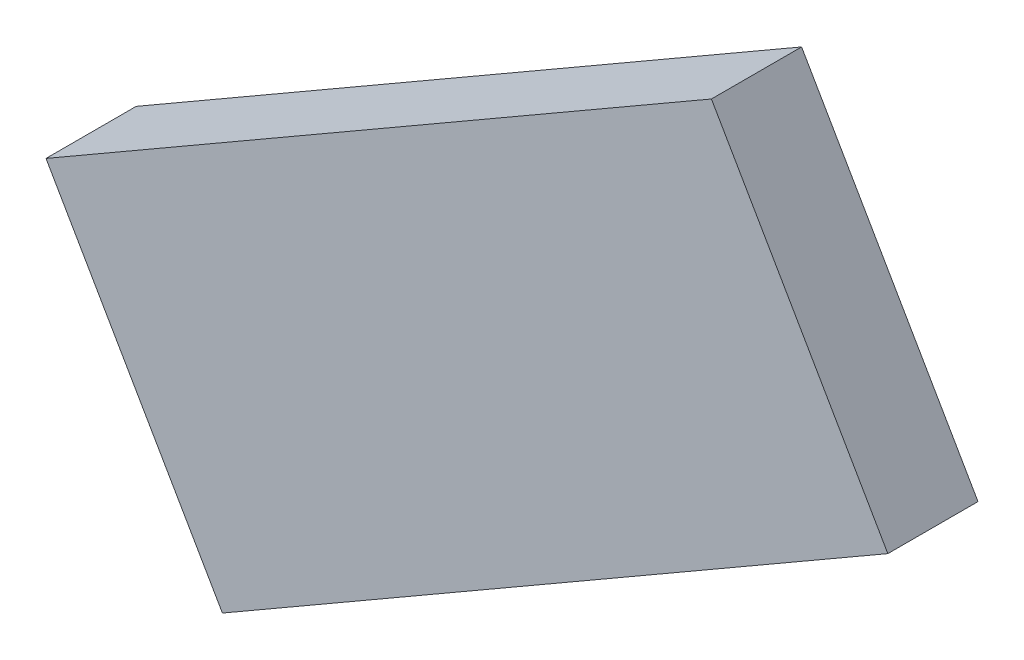
ISO-10303-21;
HEADER;
FILE_DESCRIPTION(('STEP AP214'),'2;1');
FILE_NAME('part.step','',(''),(''),'','','');
FILE_SCHEMA(('AUTOMOTIVE_DESIGN { 1 0 10303 214 1 1 1 1 }'));
ENDSEC;
DATA;
#1=APPLICATION_CONTEXT('core data for automotive mechanical design processes');
#2=APPLICATION_PROTOCOL_DEFINITION('international standard','automotive_design',2000,#1);
#3=PRODUCT_CONTEXT('',#1,'mechanical');
#4=PRODUCT('Part','Part','',(#3));
#5=PRODUCT_RELATED_PRODUCT_CATEGORY('part','',(#4));
#6=PRODUCT_DEFINITION_FORMATION('','',#4);
#7=PRODUCT_DEFINITION_CONTEXT('part definition',#1,'design');
#8=PRODUCT_DEFINITION('design','',#6,#7);
#9=PRODUCT_DEFINITION_SHAPE('','',#8);
#10=(LENGTH_UNIT() NAMED_UNIT(*) SI_UNIT(.MILLI.,.METRE.));
#11=(NAMED_UNIT(*) PLANE_ANGLE_UNIT() SI_UNIT($,.RADIAN.));
#12=(NAMED_UNIT(*) SI_UNIT($,.STERADIAN.) SOLID_ANGLE_UNIT());
#13=UNCERTAINTY_MEASURE_WITH_UNIT(LENGTH_MEASURE(1.E-05),#10,'distance_accuracy_value','');
#14=(GEOMETRIC_REPRESENTATION_CONTEXT(3) GLOBAL_UNCERTAINTY_ASSIGNED_CONTEXT((#13)) GLOBAL_UNIT_ASSIGNED_CONTEXT((#10,
#11,#12)) REPRESENTATION_CONTEXT('',''));
#15=CARTESIAN_POINT('',(0.,0.,0.));
#16=DIRECTION('',(0.,0.,1.));
#17=DIRECTION('',(1.,0.,0.));
#18=AXIS2_PLACEMENT_3D('',#15,#16,#17);
#19=CARTESIAN_POINT('',(3.1185231,4.39856118,1.15000024));
#20=DIRECTION('',(0.,0.,-1.));
#21=DIRECTION('',(-1.,0.,0.));
#22=AXIS2_PLACEMENT_3D('',#19,#20,#21);
#23=PLANE('',#22);
#24=DIRECTION('',(-0.500000090607198,0.866025351472342,0.));
#25=VECTOR('',#24,1.);
#26=CARTESIAN_POINT('',(-5.36852368,-0.50144426,1.15000024));
#27=LINE('',#26,#25);
#28=CARTESIAN_POINT('',(-5.36852367999986,-0.501444260000241,1.15000024));
#29=VERTEX_POINT('',#28);
#30=CARTESIAN_POINT('',(-3.11852310000019,-4.39855864000011,1.15000024));
#31=VERTEX_POINT('',#30);
#32=EDGE_CURVE('E54',#29,#31,#27,.F.);
#33=ORIENTED_EDGE('',*,*,#32,.T.);
#34=DIRECTION('',(-0.866025397135755,-0.500000011515858,0.));
#35=VECTOR('',#34,1.);
#36=CARTESIAN_POINT('',(-3.1185231,-4.39855864,1.15000024));
#37=LINE('',#36,#35);
#38=CARTESIAN_POINT('',(5.36852621999984,0.501441720000285,1.15000024));
#39=VERTEX_POINT('',#38);
#40=EDGE_CURVE('E56',#31,#39,#37,.F.);
#41=ORIENTED_EDGE('',*,*,#40,.T.);
#42=DIRECTION('',(0.500000025117057,-0.866025389283099,0.));
#43=VECTOR('',#42,1.);
#44=CARTESIAN_POINT('',(5.36852622,0.50144172,1.15000024));
#45=LINE('',#44,#43);
#46=CARTESIAN_POINT('',(3.11852310000087,4.3985611800005,1.15000024));
#47=VERTEX_POINT('',#46);
#48=EDGE_CURVE('E19',#39,#47,#45,.F.);
#49=ORIENTED_EDGE('',*,*,#48,.T.);
#50=DIRECTION('',(0.866025107880074,0.500000512521043,0.));
#51=VECTOR('',#50,1.);
#52=CARTESIAN_POINT('',(3.1185231,4.39856118,1.15000024));
#53=LINE('',#52,#51);
#54=EDGE_CURVE('E79',#47,#29,#53,.F.);
#55=ORIENTED_EDGE('',*,*,#54,.T.);
#56=EDGE_LOOP('',(#33,#41,#49,#55));
#57=FACE_BOUND('',#56,.T.);
#58=ADVANCED_FACE('F16',(#57),#23,.F.);
#59=CARTESIAN_POINT('',(5.36852622,0.50144172,0.));
#60=DIRECTION('',(-0.866025389283099,-0.500000025117057,0.));
#61=DIRECTION('',(0.500000025117057,-0.866025389283099,0.));
#62=AXIS2_PLACEMENT_3D('',#59,#60,#61);
#63=PLANE('',#62);
#64=DIRECTION('',(0.,0.,1.));
#65=VECTOR('',#64,1.);
#66=CARTESIAN_POINT('',(3.1185231,4.39856118,0.));
#67=LINE('',#66,#65);
#68=CARTESIAN_POINT('',(3.11852310000087,4.3985611800005,0.));
#69=VERTEX_POINT('',#68);
#70=EDGE_CURVE('E67',#69,#47,#67,.T.);
#71=ORIENTED_EDGE('',*,*,#70,.T.);
#72=ORIENTED_EDGE('',*,*,#48,.F.);
#73=DIRECTION('',(0.,0.,1.));
#74=VECTOR('',#73,1.);
#75=CARTESIAN_POINT('',(5.36852621999934,0.501441720001141,0.));
#76=LINE('',#75,#74);
#77=CARTESIAN_POINT('',(5.36852621999984,0.501441720000285,0.));
#78=VERTEX_POINT('',#77);
#79=EDGE_CURVE('E62',#39,#78,#76,.F.);
#80=ORIENTED_EDGE('',*,*,#79,.T.);
#81=DIRECTION('',(0.500000025117445,-0.866025389282875,0.));
#82=VECTOR('',#81,1.);
#83=CARTESIAN_POINT('',(3.1185231,4.39856118,0.));
#84=LINE('',#83,#82);
#85=EDGE_CURVE('E82',#69,#78,#84,.T.);
#86=ORIENTED_EDGE('',*,*,#85,.F.);
#87=EDGE_LOOP('',(#71,#72,#80,#86));
#88=FACE_BOUND('',#87,.T.);
#89=ADVANCED_FACE('F64',(#88),#63,.F.);
#90=CARTESIAN_POINT('',(-3.1185231,-4.39855864,0.));
#91=DIRECTION('',(-0.500000011515858,0.866025397135755,0.));
#92=DIRECTION('',(-0.866025397135755,-0.500000011515858,0.));
#93=AXIS2_PLACEMENT_3D('',#90,#91,#92);
#94=PLANE('',#93);
#95=ORIENTED_EDGE('',*,*,#79,.F.);
#96=ORIENTED_EDGE('',*,*,#40,.F.);
#97=DIRECTION('',(0.,0.,1.));
#98=VECTOR('',#97,1.);
#99=CARTESIAN_POINT('',(-3.11852310000074,-4.39855864000043,0.));
#100=LINE('',#99,#98);
#101=CARTESIAN_POINT('',(-3.11852310000019,-4.39855864000011,0.));
#102=VERTEX_POINT('',#101);
#103=EDGE_CURVE('E74',#31,#102,#100,.F.);
#104=ORIENTED_EDGE('',*,*,#103,.T.);
#105=DIRECTION('',(-0.866025397135822,-0.500000011515742,0.));
#106=VECTOR('',#105,1.);
#107=CARTESIAN_POINT('',(5.36852622,0.50144172,0.));
#108=LINE('',#107,#106);
#109=EDGE_CURVE('E71',#78,#102,#108,.T.);
#110=ORIENTED_EDGE('',*,*,#109,.F.);
#111=EDGE_LOOP('',(#95,#96,#104,#110));
#112=FACE_BOUND('',#111,.T.);
#113=ADVANCED_FACE('F69',(#112),#94,.F.);
#114=CARTESIAN_POINT('',(-5.36852368,-0.50144426,0.));
#115=DIRECTION('',(0.866025351472342,0.500000090607198,0.));
#116=DIRECTION('',(-0.500000090607198,0.866025351472342,0.));
#117=AXIS2_PLACEMENT_3D('',#114,#115,#116);
#118=PLANE('',#117);
#119=ORIENTED_EDGE('',*,*,#103,.F.);
#120=ORIENTED_EDGE('',*,*,#32,.F.);
#121=DIRECTION('',(0.,0.,1.));
#122=VECTOR('',#121,1.);
#123=CARTESIAN_POINT('',(-5.36852367999944,-0.501444260000966,0.));
#124=LINE('',#123,#122);
#125=CARTESIAN_POINT('',(-5.36852367999986,-0.501444260000241,0.));
#126=VERTEX_POINT('',#125);
#127=EDGE_CURVE('E34',#29,#126,#124,.F.);
#128=ORIENTED_EDGE('',*,*,#127,.T.);
#129=DIRECTION('',(-0.500000090607363,0.866025351472247,0.));
#130=VECTOR('',#129,1.);
#131=CARTESIAN_POINT('',(-3.1185231,-4.39855864,0.));
#132=LINE('',#131,#130);
#133=EDGE_CURVE('E25',#102,#126,#132,.T.);
#134=ORIENTED_EDGE('',*,*,#133,.F.);
#135=EDGE_LOOP('',(#119,#120,#128,#134));
#136=FACE_BOUND('',#135,.T.);
#137=ADVANCED_FACE('F88',(#136),#118,.F.);
#138=CARTESIAN_POINT('',(3.1185231,4.39856118,0.));
#139=DIRECTION('',(0.500000512521043,-0.866025107880074,0.));
#140=DIRECTION('',(0.866025107880074,0.500000512521043,0.));
#141=AXIS2_PLACEMENT_3D('',#138,#139,#140);
#142=PLANE('',#141);
#143=ORIENTED_EDGE('',*,*,#127,.F.);
#144=ORIENTED_EDGE('',*,*,#54,.F.);
#145=ORIENTED_EDGE('',*,*,#70,.F.);
#146=DIRECTION('',(0.866025107880131,0.500000512520944,0.));
#147=VECTOR('',#146,1.);
#148=CARTESIAN_POINT('',(-5.36852368,-0.50144426,0.));
#149=LINE('',#148,#147);
#150=EDGE_CURVE('E11',#126,#69,#149,.T.);
#151=ORIENTED_EDGE('',*,*,#150,.F.);
#152=EDGE_LOOP('',(#143,#144,#145,#151));
#153=FACE_BOUND('',#152,.T.);
#154=ADVANCED_FACE('F90',(#153),#142,.F.);
#155=CARTESIAN_POINT('',(3.1185231,4.39856118,0.));
#156=DIRECTION('',(0.,0.,-1.));
#157=DIRECTION('',(-1.,0.,0.));
#158=AXIS2_PLACEMENT_3D('',#155,#156,#157);
#159=PLANE('',#158);
#160=ORIENTED_EDGE('',*,*,#133,.T.);
#161=ORIENTED_EDGE('',*,*,#150,.T.);
#162=ORIENTED_EDGE('',*,*,#85,.T.);
#163=ORIENTED_EDGE('',*,*,#109,.T.);
#164=EDGE_LOOP('',(#160,#161,#162,#163));
#165=FACE_BOUND('',#164,.T.);
#166=ADVANCED_FACE('F87',(#165),#159,.T.);
#167=CLOSED_SHELL('',(#58,#89,#113,#137,#154,#166));
#168=MANIFOLD_SOLID_BREP('B1',#167);
#169=ADVANCED_BREP_SHAPE_REPRESENTATION('',(#18,#168),#14);
#170=SHAPE_DEFINITION_REPRESENTATION(#9,#169);
ENDSEC;
END-ISO-10303-21;
